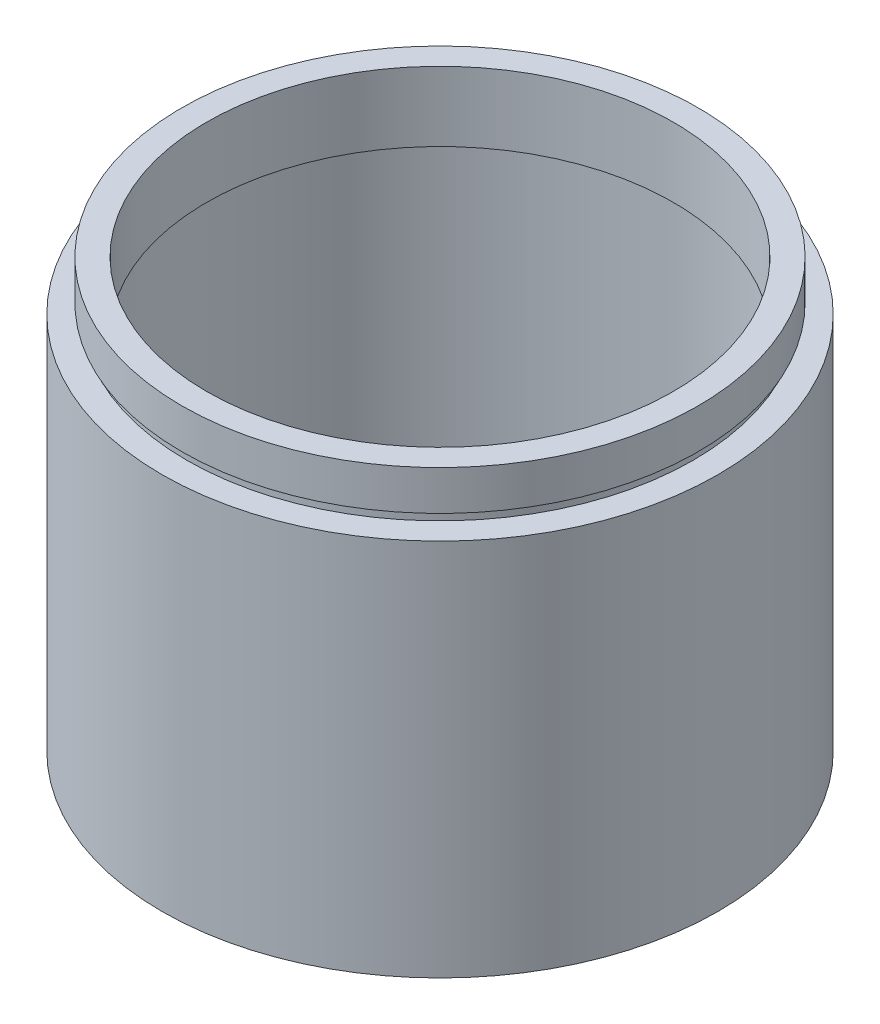
ISO-10303-21;
HEADER;
FILE_DESCRIPTION(('STEP AP214'),'2;1');
FILE_NAME('part.step','',(''),(''),'','','');
FILE_SCHEMA(('AUTOMOTIVE_DESIGN { 1 0 10303 214 1 1 1 1 }'));
ENDSEC;
DATA;
#1=APPLICATION_CONTEXT('core data for automotive mechanical design processes');
#2=APPLICATION_PROTOCOL_DEFINITION('international standard','automotive_design',2000,#1);
#3=PRODUCT_CONTEXT('',#1,'mechanical');
#4=PRODUCT('Part','Part','',(#3));
#5=PRODUCT_RELATED_PRODUCT_CATEGORY('part','',(#4));
#6=PRODUCT_DEFINITION_FORMATION('','',#4);
#7=PRODUCT_DEFINITION_CONTEXT('part definition',#1,'design');
#8=PRODUCT_DEFINITION('design','',#6,#7);
#9=PRODUCT_DEFINITION_SHAPE('','',#8);
#10=(LENGTH_UNIT() NAMED_UNIT(*) SI_UNIT(.MILLI.,.METRE.));
#11=(NAMED_UNIT(*) PLANE_ANGLE_UNIT() SI_UNIT($,.RADIAN.));
#12=(NAMED_UNIT(*) SI_UNIT($,.STERADIAN.) SOLID_ANGLE_UNIT());
#13=UNCERTAINTY_MEASURE_WITH_UNIT(LENGTH_MEASURE(1.E-05),#10,'distance_accuracy_value','');
#14=(GEOMETRIC_REPRESENTATION_CONTEXT(3) GLOBAL_UNCERTAINTY_ASSIGNED_CONTEXT((#13)) GLOBAL_UNIT_ASSIGNED_CONTEXT((#10,
#11,#12)) REPRESENTATION_CONTEXT('',''));
#15=CARTESIAN_POINT('',(0.,0.,0.));
#16=DIRECTION('',(0.,0.,1.));
#17=DIRECTION('',(1.,0.,0.));
#18=AXIS2_PLACEMENT_3D('',#15,#16,#17);
#19=CARTESIAN_POINT('',(0.,161.376166943427,0.));
#20=DIRECTION('',(0.,1.,0.));
#21=DIRECTION('',(0.,0.,1.));
#22=AXIS2_PLACEMENT_3D('',#19,#20,#21);
#23=CYLINDRICAL_SURFACE('',#22,23.5);
#24=CARTESIAN_POINT('',(0.,36.1,0.));
#25=DIRECTION('',(0.,1.,0.));
#26=DIRECTION('',(0.,0.,1.));
#27=AXIS2_PLACEMENT_3D('',#24,#25,#26);
#28=CIRCLE('',#27,23.5);
#29=CARTESIAN_POINT('',(0.,36.1,23.5));
#30=VERTEX_POINT('',#29);
#31=EDGE_CURVE('E77',#30,#30,#28,.T.);
#32=ORIENTED_EDGE('',*,*,#31,.F.);
#33=EDGE_LOOP('',(#32));
#34=FACE_BOUND('',#33,.T.);
#35=CARTESIAN_POINT('',(0.,43.1,0.));
#36=DIRECTION('',(0.,1.,0.));
#37=DIRECTION('',(0.,0.,1.));
#38=AXIS2_PLACEMENT_3D('',#35,#36,#37);
#39=CIRCLE('',#38,23.5);
#40=CARTESIAN_POINT('',(0.,43.1,23.5));
#41=VERTEX_POINT('',#40);
#42=EDGE_CURVE('E10',#41,#41,#39,.T.);
#43=ORIENTED_EDGE('',*,*,#42,.T.);
#44=EDGE_LOOP('',(#43));
#45=FACE_BOUND('',#44,.T.);
#46=ADVANCED_FACE('F37',(#34,#45),#23,.F.);
#47=CARTESIAN_POINT('',(23.5,43.1,0.));
#48=DIRECTION('',(0.,-1.,0.));
#49=DIRECTION('',(0.,0.,-1.));
#50=AXIS2_PLACEMENT_3D('',#47,#48,#49);
#51=PLANE('',#50);
#52=ORIENTED_EDGE('',*,*,#42,.F.);
#53=EDGE_LOOP('',(#52));
#54=FACE_BOUND('',#53,.T.);
#55=CARTESIAN_POINT('',(0.,43.1,0.));
#56=DIRECTION('',(0.,1.,0.));
#57=DIRECTION('',(0.,0.,1.));
#58=AXIS2_PLACEMENT_3D('',#55,#56,#57);
#59=CIRCLE('',#58,26.);
#60=CARTESIAN_POINT('',(0.,43.1,26.));
#61=VERTEX_POINT('',#60);
#62=EDGE_CURVE('E43',#61,#61,#59,.T.);
#63=ORIENTED_EDGE('',*,*,#62,.T.);
#64=EDGE_LOOP('',(#63));
#65=FACE_BOUND('',#64,.T.);
#66=ADVANCED_FACE('F84',(#54,#65),#51,.F.);
#67=CARTESIAN_POINT('',(0.,161.376166943427,0.));
#68=DIRECTION('',(0.,1.,0.));
#69=DIRECTION('',(0.,0.,1.));
#70=AXIS2_PLACEMENT_3D('',#67,#68,#69);
#71=CYLINDRICAL_SURFACE('',#70,26.);
#72=ORIENTED_EDGE('',*,*,#62,.F.);
#73=EDGE_LOOP('',(#72));
#74=FACE_BOUND('',#73,.T.);
#75=CARTESIAN_POINT('',(0.,39.1,0.));
#76=DIRECTION('',(0.,1.,0.));
#77=DIRECTION('',(0.,0.,1.));
#78=AXIS2_PLACEMENT_3D('',#75,#76,#77);
#79=CIRCLE('',#78,26.);
#80=CARTESIAN_POINT('',(0.,39.1,26.));
#81=VERTEX_POINT('',#80);
#82=EDGE_CURVE('E47',#81,#81,#79,.T.);
#83=ORIENTED_EDGE('',*,*,#82,.T.);
#84=EDGE_LOOP('',(#83));
#85=FACE_BOUND('',#84,.T.);
#86=ADVANCED_FACE('F88',(#74,#85),#71,.T.);
#87=CARTESIAN_POINT('',(26.,39.1,0.));
#88=DIRECTION('',(0.,1.,0.));
#89=DIRECTION('',(0.,0.,1.));
#90=AXIS2_PLACEMENT_3D('',#87,#88,#89);
#91=PLANE('',#90);
#92=ORIENTED_EDGE('',*,*,#82,.F.);
#93=EDGE_LOOP('',(#92));
#94=FACE_BOUND('',#93,.T.);
#95=CARTESIAN_POINT('',(0.,39.1,0.));
#96=DIRECTION('',(0.,1.,0.));
#97=DIRECTION('',(0.,0.,1.));
#98=AXIS2_PLACEMENT_3D('',#95,#96,#97);
#99=CIRCLE('',#98,25.5);
#100=CARTESIAN_POINT('',(0.,39.1,25.5));
#101=VERTEX_POINT('',#100);
#102=EDGE_CURVE('E51',#101,#101,#99,.T.);
#103=ORIENTED_EDGE('',*,*,#102,.T.);
#104=EDGE_LOOP('',(#103));
#105=FACE_BOUND('',#104,.T.);
#106=ADVANCED_FACE('F93',(#94,#105),#91,.F.);
#107=CARTESIAN_POINT('',(0.,161.376166943427,0.));
#108=DIRECTION('',(0.,1.,0.));
#109=DIRECTION('',(0.,0.,1.));
#110=AXIS2_PLACEMENT_3D('',#107,#108,#109);
#111=CYLINDRICAL_SURFACE('',#110,25.5);
#112=ORIENTED_EDGE('',*,*,#102,.F.);
#113=EDGE_LOOP('',(#112));
#114=FACE_BOUND('',#113,.T.);
#115=CARTESIAN_POINT('',(0.,38.1,0.));
#116=DIRECTION('',(0.,1.,0.));
#117=DIRECTION('',(0.,0.,1.));
#118=AXIS2_PLACEMENT_3D('',#115,#116,#117);
#119=CIRCLE('',#118,25.5);
#120=CARTESIAN_POINT('',(0.,38.1,25.5));
#121=VERTEX_POINT('',#120);
#122=EDGE_CURVE('E56',#121,#121,#119,.T.);
#123=ORIENTED_EDGE('',*,*,#122,.T.);
#124=EDGE_LOOP('',(#123));
#125=FACE_BOUND('',#124,.T.);
#126=ADVANCED_FACE('F99',(#114,#125),#111,.T.);
#127=CARTESIAN_POINT('',(25.5,38.1,0.));
#128=DIRECTION('',(0.,-1.,0.));
#129=DIRECTION('',(0.,0.,-1.));
#130=AXIS2_PLACEMENT_3D('',#127,#128,#129);
#131=PLANE('',#130);
#132=ORIENTED_EDGE('',*,*,#122,.F.);
#133=EDGE_LOOP('',(#132));
#134=FACE_BOUND('',#133,.T.);
#135=CARTESIAN_POINT('',(0.,38.1,0.));
#136=DIRECTION('',(0.,1.,0.));
#137=DIRECTION('',(0.,0.,1.));
#138=AXIS2_PLACEMENT_3D('',#135,#136,#137);
#139=CIRCLE('',#138,28.);
#140=CARTESIAN_POINT('',(0.,38.1,28.));
#141=VERTEX_POINT('',#140);
#142=EDGE_CURVE('E59',#141,#141,#139,.T.);
#143=ORIENTED_EDGE('',*,*,#142,.T.);
#144=EDGE_LOOP('',(#143));
#145=FACE_BOUND('',#144,.T.);
#146=ADVANCED_FACE('F103',(#134,#145),#131,.F.);
#147=CARTESIAN_POINT('',(0.,161.376166943427,0.));
#148=DIRECTION('',(0.,1.,0.));
#149=DIRECTION('',(0.,0.,1.));
#150=AXIS2_PLACEMENT_3D('',#147,#148,#149);
#151=CYLINDRICAL_SURFACE('',#150,28.);
#152=ORIENTED_EDGE('',*,*,#142,.F.);
#153=EDGE_LOOP('',(#152));
#154=FACE_BOUND('',#153,.T.);
#155=CARTESIAN_POINT('',(0.,0.,0.));
#156=DIRECTION('',(0.,1.,0.));
#157=DIRECTION('',(0.,0.,1.));
#158=AXIS2_PLACEMENT_3D('',#155,#156,#157);
#159=CIRCLE('',#158,28.);
#160=CARTESIAN_POINT('',(0.,0.,28.));
#161=VERTEX_POINT('',#160);
#162=EDGE_CURVE('E62',#161,#161,#159,.T.);
#163=ORIENTED_EDGE('',*,*,#162,.T.);
#164=EDGE_LOOP('',(#163));
#165=FACE_BOUND('',#164,.T.);
#166=ADVANCED_FACE('F107',(#154,#165),#151,.T.);
#167=CARTESIAN_POINT('',(28.,0.,0.));
#168=DIRECTION('',(0.,1.,0.));
#169=DIRECTION('',(0.,0.,1.));
#170=AXIS2_PLACEMENT_3D('',#167,#168,#169);
#171=PLANE('',#170);
#172=ORIENTED_EDGE('',*,*,#162,.F.);
#173=EDGE_LOOP('',(#172));
#174=FACE_BOUND('',#173,.T.);
#175=CARTESIAN_POINT('',(0.,0.,0.));
#176=DIRECTION('',(0.,1.,0.));
#177=DIRECTION('',(0.,0.,1.));
#178=AXIS2_PLACEMENT_3D('',#175,#176,#177);
#179=CIRCLE('',#178,25.5);
#180=CARTESIAN_POINT('',(0.,0.,25.5));
#181=VERTEX_POINT('',#180);
#182=EDGE_CURVE('E65',#181,#181,#179,.T.);
#183=ORIENTED_EDGE('',*,*,#182,.T.);
#184=EDGE_LOOP('',(#183));
#185=FACE_BOUND('',#184,.T.);
#186=ADVANCED_FACE('F111',(#174,#185),#171,.F.);
#187=CARTESIAN_POINT('',(0.,161.376166943427,0.));
#188=DIRECTION('',(0.,1.,0.));
#189=DIRECTION('',(0.,0.,1.));
#190=AXIS2_PLACEMENT_3D('',#187,#188,#189);
#191=CYLINDRICAL_SURFACE('',#190,25.5);
#192=ORIENTED_EDGE('',*,*,#182,.F.);
#193=EDGE_LOOP('',(#192));
#194=FACE_BOUND('',#193,.T.);
#195=CARTESIAN_POINT('',(0.,35.1,0.));
#196=DIRECTION('',(0.,1.,0.));
#197=DIRECTION('',(0.,0.,1.));
#198=AXIS2_PLACEMENT_3D('',#195,#196,#197);
#199=CIRCLE('',#198,25.5);
#200=CARTESIAN_POINT('',(0.,35.1,25.5));
#201=VERTEX_POINT('',#200);
#202=EDGE_CURVE('E68',#201,#201,#199,.T.);
#203=ORIENTED_EDGE('',*,*,#202,.T.);
#204=EDGE_LOOP('',(#203));
#205=FACE_BOUND('',#204,.T.);
#206=ADVANCED_FACE('F115',(#194,#205),#191,.F.);
#207=CARTESIAN_POINT('',(25.5,35.1,0.));
#208=DIRECTION('',(0.,-1.,0.));
#209=DIRECTION('',(0.,0.,-1.));
#210=AXIS2_PLACEMENT_3D('',#207,#208,#209);
#211=PLANE('',#210);
#212=ORIENTED_EDGE('',*,*,#202,.F.);
#213=EDGE_LOOP('',(#212));
#214=FACE_BOUND('',#213,.T.);
#215=CARTESIAN_POINT('',(0.,35.1,0.));
#216=DIRECTION('',(0.,1.,0.));
#217=DIRECTION('',(0.,0.,1.));
#218=AXIS2_PLACEMENT_3D('',#215,#216,#217);
#219=CIRCLE('',#218,26.1);
#220=CARTESIAN_POINT('',(0.,35.1,26.1));
#221=VERTEX_POINT('',#220);
#222=EDGE_CURVE('E71',#221,#221,#219,.T.);
#223=ORIENTED_EDGE('',*,*,#222,.T.);
#224=EDGE_LOOP('',(#223));
#225=FACE_BOUND('',#224,.T.);
#226=ADVANCED_FACE('F119',(#214,#225),#211,.F.);
#227=CARTESIAN_POINT('',(0.,161.376166943427,0.));
#228=DIRECTION('',(0.,1.,0.));
#229=DIRECTION('',(0.,0.,1.));
#230=AXIS2_PLACEMENT_3D('',#227,#228,#229);
#231=CYLINDRICAL_SURFACE('',#230,26.1);
#232=ORIENTED_EDGE('',*,*,#222,.F.);
#233=EDGE_LOOP('',(#232));
#234=FACE_BOUND('',#233,.T.);
#235=CARTESIAN_POINT('',(0.,36.1,0.));
#236=DIRECTION('',(0.,1.,0.));
#237=DIRECTION('',(0.,0.,1.));
#238=AXIS2_PLACEMENT_3D('',#235,#236,#237);
#239=CIRCLE('',#238,26.1);
#240=CARTESIAN_POINT('',(0.,36.1,26.1));
#241=VERTEX_POINT('',#240);
#242=EDGE_CURVE('E74',#241,#241,#239,.T.);
#243=ORIENTED_EDGE('',*,*,#242,.T.);
#244=EDGE_LOOP('',(#243));
#245=FACE_BOUND('',#244,.T.);
#246=ADVANCED_FACE('F123',(#234,#245),#231,.F.);
#247=CARTESIAN_POINT('',(26.1,36.1,0.));
#248=DIRECTION('',(0.,1.,0.));
#249=DIRECTION('',(0.,0.,1.));
#250=AXIS2_PLACEMENT_3D('',#247,#248,#249);
#251=PLANE('',#250);
#252=ORIENTED_EDGE('',*,*,#242,.F.);
#253=EDGE_LOOP('',(#252));
#254=FACE_BOUND('',#253,.T.);
#255=ORIENTED_EDGE('',*,*,#31,.T.);
#256=EDGE_LOOP('',(#255));
#257=FACE_BOUND('',#256,.T.);
#258=ADVANCED_FACE('F81',(#254,#257),#251,.F.);
#259=CLOSED_SHELL('',(#46,#66,#86,#106,#126,#146,#166,#186,#206,#226,#246,#258));
#260=MANIFOLD_SOLID_BREP('B2',#259);
#261=ADVANCED_BREP_SHAPE_REPRESENTATION('',(#18,#260),#14);
#262=SHAPE_DEFINITION_REPRESENTATION(#9,#261);
ENDSEC;
END-ISO-10303-21;
